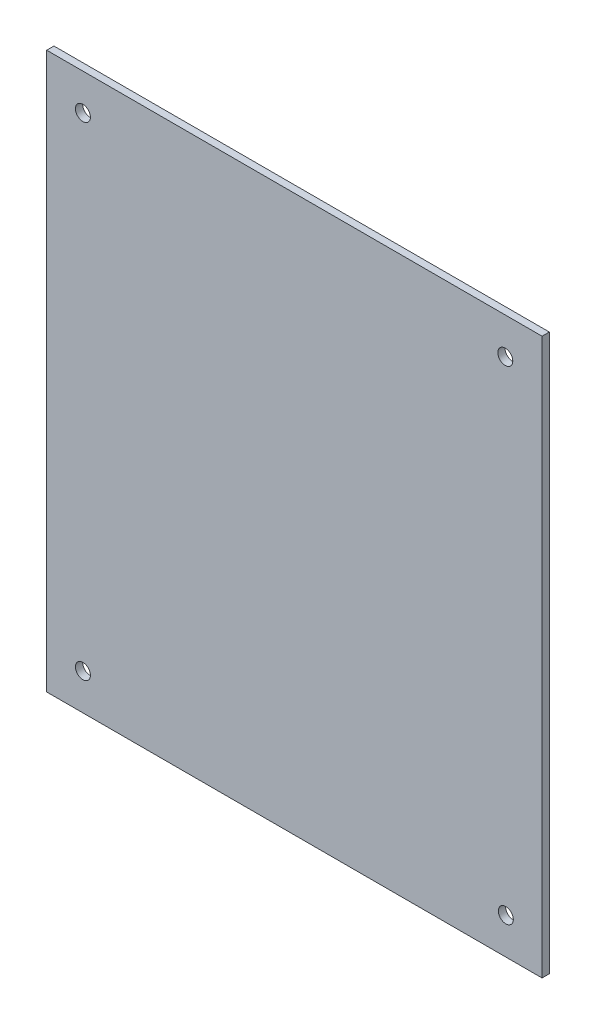
ISO-10303-21;
HEADER;
FILE_DESCRIPTION(('STEP AP214'),'2;1');
FILE_NAME('part.step','',(''),(''),'','','');
FILE_SCHEMA(('AUTOMOTIVE_DESIGN { 1 0 10303 214 1 1 1 1 }'));
ENDSEC;
DATA;
#1=APPLICATION_CONTEXT('core data for automotive mechanical design processes');
#2=APPLICATION_PROTOCOL_DEFINITION('international standard','automotive_design',2000,#1);
#3=PRODUCT_CONTEXT('',#1,'mechanical');
#4=PRODUCT('Part','Part','',(#3));
#5=PRODUCT_RELATED_PRODUCT_CATEGORY('part','',(#4));
#6=PRODUCT_DEFINITION_FORMATION('','',#4);
#7=PRODUCT_DEFINITION_CONTEXT('part definition',#1,'design');
#8=PRODUCT_DEFINITION('design','',#6,#7);
#9=PRODUCT_DEFINITION_SHAPE('','',#8);
#10=(LENGTH_UNIT() NAMED_UNIT(*) SI_UNIT(.MILLI.,.METRE.));
#11=(NAMED_UNIT(*) PLANE_ANGLE_UNIT() SI_UNIT($,.RADIAN.));
#12=(NAMED_UNIT(*) SI_UNIT($,.STERADIAN.) SOLID_ANGLE_UNIT());
#13=UNCERTAINTY_MEASURE_WITH_UNIT(LENGTH_MEASURE(1.E-05),#10,'distance_accuracy_value','');
#14=(GEOMETRIC_REPRESENTATION_CONTEXT(3) GLOBAL_UNCERTAINTY_ASSIGNED_CONTEXT((#13)) GLOBAL_UNIT_ASSIGNED_CONTEXT((#10,
#11,#12)) REPRESENTATION_CONTEXT('',''));
#15=CARTESIAN_POINT('',(0.,0.,0.));
#16=DIRECTION('',(0.,0.,1.));
#17=DIRECTION('',(1.,0.,0.));
#18=AXIS2_PLACEMENT_3D('',#15,#16,#17);
#19=CARTESIAN_POINT('',(0.,0.,3.));
#20=DIRECTION('',(0.,0.,1.));
#21=DIRECTION('',(1.,0.,0.));
#22=AXIS2_PLACEMENT_3D('',#19,#20,#21);
#23=PLANE('',#22);
#24=CARTESIAN_POINT('',(-87.5,-100.,3.));
#25=DIRECTION('',(0.,0.,1.));
#26=DIRECTION('',(1.,0.,0.));
#27=AXIS2_PLACEMENT_3D('',#24,#25,#26);
#28=CIRCLE('',#27,3.1);
#29=CARTESIAN_POINT('',(-84.4,-100.,3.));
#30=VERTEX_POINT('',#29);
#31=EDGE_CURVE('E142',#30,#30,#28,.T.);
#32=ORIENTED_EDGE('',*,*,#31,.F.);
#33=EDGE_LOOP('',(#32));
#34=FACE_BOUND('',#33,.T.);
#35=CARTESIAN_POINT('',(-87.5,100.,3.));
#36=DIRECTION('',(0.,0.,1.));
#37=DIRECTION('',(1.,0.,0.));
#38=AXIS2_PLACEMENT_3D('',#35,#36,#37);
#39=CIRCLE('',#38,3.1);
#40=CARTESIAN_POINT('',(-84.4,100.,3.));
#41=VERTEX_POINT('',#40);
#42=EDGE_CURVE('E112',#41,#41,#39,.T.);
#43=ORIENTED_EDGE('',*,*,#42,.F.);
#44=EDGE_LOOP('',(#43));
#45=FACE_BOUND('',#44,.T.);
#46=DIRECTION('',(0.,1.,0.));
#47=VECTOR('',#46,1.);
#48=CARTESIAN_POINT('',(102.5,115.,3.));
#49=LINE('',#48,#47);
#50=CARTESIAN_POINT('',(102.5,-115.,3.));
#51=VERTEX_POINT('',#50);
#52=CARTESIAN_POINT('',(102.5,115.,3.));
#53=VERTEX_POINT('',#52);
#54=EDGE_CURVE('E92',#51,#53,#49,.T.);
#55=ORIENTED_EDGE('',*,*,#54,.T.);
#56=DIRECTION('',(-1.,0.,0.));
#57=VECTOR('',#56,1.);
#58=CARTESIAN_POINT('',(-102.5,115.,3.));
#59=LINE('',#58,#57);
#60=CARTESIAN_POINT('',(-102.5,115.,3.));
#61=VERTEX_POINT('',#60);
#62=EDGE_CURVE('E87',#53,#61,#59,.T.);
#63=ORIENTED_EDGE('',*,*,#62,.T.);
#64=DIRECTION('',(0.,-1.,0.));
#65=VECTOR('',#64,1.);
#66=CARTESIAN_POINT('',(-102.5,115.,3.));
#67=LINE('',#66,#65);
#68=CARTESIAN_POINT('',(-102.5,-115.,3.));
#69=VERTEX_POINT('',#68);
#70=EDGE_CURVE('E90',#61,#69,#67,.T.);
#71=ORIENTED_EDGE('',*,*,#70,.T.);
#72=DIRECTION('',(1.,0.,0.));
#73=VECTOR('',#72,1.);
#74=CARTESIAN_POINT('',(-102.5,-115.,3.));
#75=LINE('',#74,#73);
#76=EDGE_CURVE('E57',#69,#51,#75,.T.);
#77=ORIENTED_EDGE('',*,*,#76,.T.);
#78=EDGE_LOOP('',(#55,#63,#71,#77));
#79=FACE_BOUND('',#78,.T.);
#80=CARTESIAN_POINT('',(87.2751748745168,100.,3.));
#81=DIRECTION('',(0.,0.,1.));
#82=DIRECTION('',(1.,0.,0.));
#83=AXIS2_PLACEMENT_3D('',#80,#81,#82);
#84=CIRCLE('',#83,3.09999999999999);
#85=CARTESIAN_POINT('',(90.3751748745168,100.,3.));
#86=VERTEX_POINT('',#85);
#87=EDGE_CURVE('E134',#86,#86,#84,.T.);
#88=ORIENTED_EDGE('',*,*,#87,.F.);
#89=EDGE_LOOP('',(#88));
#90=FACE_BOUND('',#89,.T.);
#91=CARTESIAN_POINT('',(87.5,-100.,3.));
#92=DIRECTION('',(0.,0.,1.));
#93=DIRECTION('',(1.,0.,0.));
#94=AXIS2_PLACEMENT_3D('',#91,#92,#93);
#95=CIRCLE('',#94,3.09999999999999);
#96=CARTESIAN_POINT('',(90.6,-100.,3.));
#97=VERTEX_POINT('',#96);
#98=EDGE_CURVE('E150',#97,#97,#95,.T.);
#99=ORIENTED_EDGE('',*,*,#98,.F.);
#100=EDGE_LOOP('',(#99));
#101=FACE_BOUND('',#100,.T.);
#102=ADVANCED_FACE('F39',(#34,#45,#79,#90,#101),#23,.T.);
#103=CARTESIAN_POINT('',(0.,0.,0.));
#104=DIRECTION('',(0.,0.,1.));
#105=DIRECTION('',(1.,0.,0.));
#106=AXIS2_PLACEMENT_3D('',#103,#104,#105);
#107=PLANE('',#106);
#108=DIRECTION('',(0.,1.,0.));
#109=VECTOR('',#108,1.);
#110=CARTESIAN_POINT('',(102.5,115.,0.));
#111=LINE('',#110,#109);
#112=CARTESIAN_POINT('',(102.5,-115.,0.));
#113=VERTEX_POINT('',#112);
#114=CARTESIAN_POINT('',(102.5,115.,0.));
#115=VERTEX_POINT('',#114);
#116=EDGE_CURVE('E108',#113,#115,#111,.T.);
#117=ORIENTED_EDGE('',*,*,#116,.F.);
#118=DIRECTION('',(1.,0.,0.));
#119=VECTOR('',#118,1.);
#120=CARTESIAN_POINT('',(-102.5,-115.,0.));
#121=LINE('',#120,#119);
#122=CARTESIAN_POINT('',(-102.5,-115.,0.));
#123=VERTEX_POINT('',#122);
#124=EDGE_CURVE('E80',#123,#113,#121,.T.);
#125=ORIENTED_EDGE('',*,*,#124,.F.);
#126=DIRECTION('',(0.,-1.,0.));
#127=VECTOR('',#126,1.);
#128=CARTESIAN_POINT('',(-102.5,115.,0.));
#129=LINE('',#128,#127);
#130=CARTESIAN_POINT('',(-102.5,115.,0.));
#131=VERTEX_POINT('',#130);
#132=EDGE_CURVE('E74',#131,#123,#129,.T.);
#133=ORIENTED_EDGE('',*,*,#132,.F.);
#134=DIRECTION('',(-1.,0.,0.));
#135=VECTOR('',#134,1.);
#136=CARTESIAN_POINT('',(-102.5,115.,0.));
#137=LINE('',#136,#135);
#138=EDGE_CURVE('E97',#115,#131,#137,.T.);
#139=ORIENTED_EDGE('',*,*,#138,.F.);
#140=EDGE_LOOP('',(#117,#125,#133,#139));
#141=FACE_BOUND('',#140,.T.);
#142=CARTESIAN_POINT('',(-87.5,100.,0.));
#143=DIRECTION('',(0.,0.,1.));
#144=DIRECTION('',(1.,0.,0.));
#145=AXIS2_PLACEMENT_3D('',#142,#143,#144);
#146=CIRCLE('',#145,3.1);
#147=CARTESIAN_POINT('',(-84.4,100.,0.));
#148=VERTEX_POINT('',#147);
#149=EDGE_CURVE('E130',#148,#148,#146,.T.);
#150=ORIENTED_EDGE('',*,*,#149,.T.);
#151=EDGE_LOOP('',(#150));
#152=FACE_BOUND('',#151,.T.);
#153=CARTESIAN_POINT('',(87.2751748745168,100.,0.));
#154=DIRECTION('',(0.,0.,1.));
#155=DIRECTION('',(1.,0.,0.));
#156=AXIS2_PLACEMENT_3D('',#153,#154,#155);
#157=CIRCLE('',#156,3.09999999999999);
#158=CARTESIAN_POINT('',(90.3751748745168,100.,0.));
#159=VERTEX_POINT('',#158);
#160=EDGE_CURVE('E138',#159,#159,#157,.T.);
#161=ORIENTED_EDGE('',*,*,#160,.T.);
#162=EDGE_LOOP('',(#161));
#163=FACE_BOUND('',#162,.T.);
#164=CARTESIAN_POINT('',(-87.5,-100.,0.));
#165=DIRECTION('',(0.,0.,1.));
#166=DIRECTION('',(1.,0.,0.));
#167=AXIS2_PLACEMENT_3D('',#164,#165,#166);
#168=CIRCLE('',#167,3.1);
#169=CARTESIAN_POINT('',(-84.4,-100.,0.));
#170=VERTEX_POINT('',#169);
#171=EDGE_CURVE('E146',#170,#170,#168,.T.);
#172=ORIENTED_EDGE('',*,*,#171,.T.);
#173=EDGE_LOOP('',(#172));
#174=FACE_BOUND('',#173,.T.);
#175=CARTESIAN_POINT('',(87.5,-100.,0.));
#176=DIRECTION('',(0.,0.,1.));
#177=DIRECTION('',(1.,0.,0.));
#178=AXIS2_PLACEMENT_3D('',#175,#176,#177);
#179=CIRCLE('',#178,3.09999999999999);
#180=CARTESIAN_POINT('',(90.6,-100.,0.));
#181=VERTEX_POINT('',#180);
#182=EDGE_CURVE('E154',#181,#181,#179,.T.);
#183=ORIENTED_EDGE('',*,*,#182,.T.);
#184=EDGE_LOOP('',(#183));
#185=FACE_BOUND('',#184,.T.);
#186=ADVANCED_FACE('F125',(#141,#152,#163,#174,#185),#107,.F.);
#187=CARTESIAN_POINT('',(102.5,115.,3.));
#188=DIRECTION('',(-1.,0.,0.));
#189=DIRECTION('',(0.,0.,1.));
#190=AXIS2_PLACEMENT_3D('',#187,#188,#189);
#191=PLANE('',#190);
#192=ORIENTED_EDGE('',*,*,#116,.T.);
#193=DIRECTION('',(0.,0.,-1.));
#194=VECTOR('',#193,1.);
#195=CARTESIAN_POINT('',(102.5,115.,3.));
#196=LINE('',#195,#194);
#197=EDGE_CURVE('E11',#53,#115,#196,.T.);
#198=ORIENTED_EDGE('',*,*,#197,.F.);
#199=ORIENTED_EDGE('',*,*,#54,.F.);
#200=DIRECTION('',(0.,0.,-1.));
#201=VECTOR('',#200,1.);
#202=CARTESIAN_POINT('',(102.5,-115.,3.));
#203=LINE('',#202,#201);
#204=EDGE_CURVE('E104',#51,#113,#203,.T.);
#205=ORIENTED_EDGE('',*,*,#204,.T.);
#206=EDGE_LOOP('',(#192,#198,#199,#205));
#207=FACE_BOUND('',#206,.T.);
#208=ADVANCED_FACE('F41',(#207),#191,.F.);
#209=CARTESIAN_POINT('',(-102.5,115.,3.));
#210=DIRECTION('',(0.,-1.,0.));
#211=DIRECTION('',(0.,0.,-1.));
#212=AXIS2_PLACEMENT_3D('',#209,#210,#211);
#213=PLANE('',#212);
#214=ORIENTED_EDGE('',*,*,#138,.T.);
#215=DIRECTION('',(0.,0.,-1.));
#216=VECTOR('',#215,1.);
#217=CARTESIAN_POINT('',(-102.5,115.,3.));
#218=LINE('',#217,#216);
#219=EDGE_CURVE('E49',#61,#131,#218,.T.);
#220=ORIENTED_EDGE('',*,*,#219,.F.);
#221=ORIENTED_EDGE('',*,*,#62,.F.);
#222=ORIENTED_EDGE('',*,*,#197,.T.);
#223=EDGE_LOOP('',(#214,#220,#221,#222));
#224=FACE_BOUND('',#223,.T.);
#225=ADVANCED_FACE('F96',(#224),#213,.F.);
#226=CARTESIAN_POINT('',(-102.5,115.,3.));
#227=DIRECTION('',(1.,0.,0.));
#228=DIRECTION('',(0.,0.,-1.));
#229=AXIS2_PLACEMENT_3D('',#226,#227,#228);
#230=PLANE('',#229);
#231=ORIENTED_EDGE('',*,*,#132,.T.);
#232=DIRECTION('',(0.,0.,-1.));
#233=VECTOR('',#232,1.);
#234=CARTESIAN_POINT('',(-102.5,-115.,3.));
#235=LINE('',#234,#233);
#236=EDGE_CURVE('E99',#69,#123,#235,.T.);
#237=ORIENTED_EDGE('',*,*,#236,.F.);
#238=ORIENTED_EDGE('',*,*,#70,.F.);
#239=ORIENTED_EDGE('',*,*,#219,.T.);
#240=EDGE_LOOP('',(#231,#237,#238,#239));
#241=FACE_BOUND('',#240,.T.);
#242=ADVANCED_FACE('F100',(#241),#230,.F.);
#243=CARTESIAN_POINT('',(-102.5,-115.,3.));
#244=DIRECTION('',(0.,1.,0.));
#245=DIRECTION('',(0.,0.,1.));
#246=AXIS2_PLACEMENT_3D('',#243,#244,#245);
#247=PLANE('',#246);
#248=ORIENTED_EDGE('',*,*,#124,.T.);
#249=ORIENTED_EDGE('',*,*,#204,.F.);
#250=ORIENTED_EDGE('',*,*,#76,.F.);
#251=ORIENTED_EDGE('',*,*,#236,.T.);
#252=EDGE_LOOP('',(#248,#249,#250,#251));
#253=FACE_BOUND('',#252,.T.);
#254=ADVANCED_FACE('F122',(#253),#247,.F.);
#255=CARTESIAN_POINT('',(-87.5,100.,3.));
#256=DIRECTION('',(0.,0.,-1.));
#257=DIRECTION('',(-1.,0.,0.));
#258=AXIS2_PLACEMENT_3D('',#255,#256,#257);
#259=CYLINDRICAL_SURFACE('',#258,3.1);
#260=ORIENTED_EDGE('',*,*,#42,.T.);
#261=EDGE_LOOP('',(#260));
#262=FACE_BOUND('',#261,.T.);
#263=ORIENTED_EDGE('',*,*,#149,.F.);
#264=EDGE_LOOP('',(#263));
#265=FACE_BOUND('',#264,.T.);
#266=ADVANCED_FACE('F175',(#262,#265),#259,.F.);
#267=CARTESIAN_POINT('',(87.2751748745168,100.,3.));
#268=DIRECTION('',(0.,0.,-1.));
#269=DIRECTION('',(-1.,0.,0.));
#270=AXIS2_PLACEMENT_3D('',#267,#268,#269);
#271=CYLINDRICAL_SURFACE('',#270,3.09999999999999);
#272=ORIENTED_EDGE('',*,*,#87,.T.);
#273=EDGE_LOOP('',(#272));
#274=FACE_BOUND('',#273,.T.);
#275=ORIENTED_EDGE('',*,*,#160,.F.);
#276=EDGE_LOOP('',(#275));
#277=FACE_BOUND('',#276,.T.);
#278=ADVANCED_FACE('F221',(#274,#277),#271,.F.);
#279=CARTESIAN_POINT('',(-87.5,-100.,3.));
#280=DIRECTION('',(0.,0.,-1.));
#281=DIRECTION('',(-1.,0.,0.));
#282=AXIS2_PLACEMENT_3D('',#279,#280,#281);
#283=CYLINDRICAL_SURFACE('',#282,3.1);
#284=ORIENTED_EDGE('',*,*,#31,.T.);
#285=EDGE_LOOP('',(#284));
#286=FACE_BOUND('',#285,.T.);
#287=ORIENTED_EDGE('',*,*,#171,.F.);
#288=EDGE_LOOP('',(#287));
#289=FACE_BOUND('',#288,.T.);
#290=ADVANCED_FACE('F229',(#286,#289),#283,.F.);
#291=CARTESIAN_POINT('',(87.5,-100.,3.));
#292=DIRECTION('',(0.,0.,-1.));
#293=DIRECTION('',(-1.,0.,0.));
#294=AXIS2_PLACEMENT_3D('',#291,#292,#293);
#295=CYLINDRICAL_SURFACE('',#294,3.09999999999999);
#296=ORIENTED_EDGE('',*,*,#98,.T.);
#297=EDGE_LOOP('',(#296));
#298=FACE_BOUND('',#297,.T.);
#299=ORIENTED_EDGE('',*,*,#182,.F.);
#300=EDGE_LOOP('',(#299));
#301=FACE_BOUND('',#300,.T.);
#302=ADVANCED_FACE('F162',(#298,#301),#295,.F.);
#303=CLOSED_SHELL('',(#102,#186,#208,#225,#242,#254,#266,#278,#290,#302));
#304=MANIFOLD_SOLID_BREP('B2',#303);
#305=ADVANCED_BREP_SHAPE_REPRESENTATION('',(#18,#304),#14);
#306=SHAPE_DEFINITION_REPRESENTATION(#9,#305);
ENDSEC;
END-ISO-10303-21;
